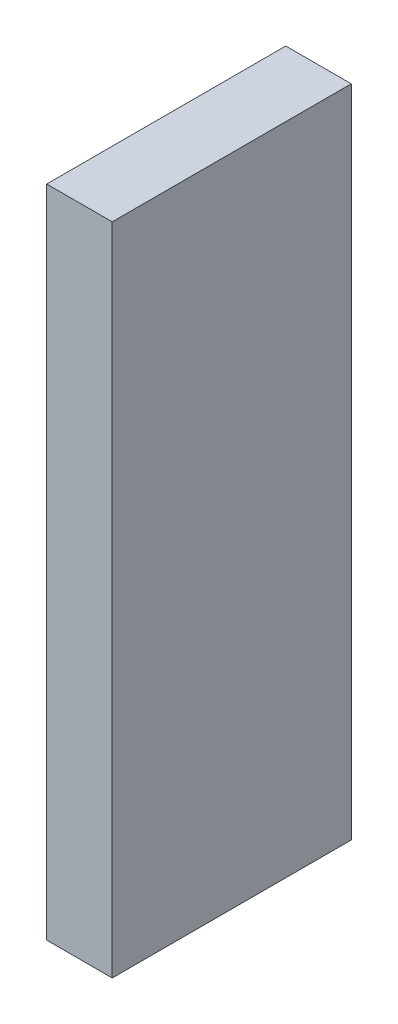
ISO-10303-21;
HEADER;
FILE_DESCRIPTION(('STEP AP214'),'2;1');
FILE_NAME('part.step','',(''),(''),'','','');
FILE_SCHEMA(('AUTOMOTIVE_DESIGN { 1 0 10303 214 1 1 1 1 }'));
ENDSEC;
DATA;
#1=APPLICATION_CONTEXT('core data for automotive mechanical design processes');
#2=APPLICATION_PROTOCOL_DEFINITION('international standard','automotive_design',2000,#1);
#3=PRODUCT_CONTEXT('',#1,'mechanical');
#4=PRODUCT('Part','Part','',(#3));
#5=PRODUCT_RELATED_PRODUCT_CATEGORY('part','',(#4));
#6=PRODUCT_DEFINITION_FORMATION('','',#4);
#7=PRODUCT_DEFINITION_CONTEXT('part definition',#1,'design');
#8=PRODUCT_DEFINITION('design','',#6,#7);
#9=PRODUCT_DEFINITION_SHAPE('','',#8);
#10=(LENGTH_UNIT() NAMED_UNIT(*) SI_UNIT(.MILLI.,.METRE.));
#11=(NAMED_UNIT(*) PLANE_ANGLE_UNIT() SI_UNIT($,.RADIAN.));
#12=(NAMED_UNIT(*) SI_UNIT($,.STERADIAN.) SOLID_ANGLE_UNIT());
#13=UNCERTAINTY_MEASURE_WITH_UNIT(LENGTH_MEASURE(1.E-05),#10,'distance_accuracy_value','');
#14=(GEOMETRIC_REPRESENTATION_CONTEXT(3) GLOBAL_UNCERTAINTY_ASSIGNED_CONTEXT((#13)) GLOBAL_UNIT_ASSIGNED_CONTEXT((#10,
#11,#12)) REPRESENTATION_CONTEXT('',''));
#15=CARTESIAN_POINT('',(0.,0.,0.));
#16=DIRECTION('',(0.,0.,1.));
#17=DIRECTION('',(1.,0.,0.));
#18=AXIS2_PLACEMENT_3D('',#15,#16,#17);
#19=CARTESIAN_POINT('',(1.27,12.7,4.6355));
#20=DIRECTION('',(-1.,0.,0.));
#21=DIRECTION('',(0.,-1.,0.));
#22=AXIS2_PLACEMENT_3D('',#19,#20,#21);
#23=PLANE('',#22);
#24=DIRECTION('',(0.,1.,0.));
#25=VECTOR('',#24,1.);
#26=CARTESIAN_POINT('',(1.27,12.7,-4.6355));
#27=LINE('',#26,#25);
#28=CARTESIAN_POINT('',(1.27,-12.7,-4.6355));
#29=VERTEX_POINT('',#28);
#30=CARTESIAN_POINT('',(1.27,12.7,-4.6355));
#31=VERTEX_POINT('',#30);
#32=EDGE_CURVE('E111',#29,#31,#27,.T.);
#33=ORIENTED_EDGE('',*,*,#32,.T.);
#34=DIRECTION('',(0.,0.,-1.));
#35=VECTOR('',#34,1.);
#36=CARTESIAN_POINT('',(1.27,12.7,4.6355));
#37=LINE('',#36,#35);
#38=CARTESIAN_POINT('',(1.27,12.7,4.6355));
#39=VERTEX_POINT('',#38);
#40=EDGE_CURVE('E11',#39,#31,#37,.T.);
#41=ORIENTED_EDGE('',*,*,#40,.F.);
#42=DIRECTION('',(0.,1.,0.));
#43=VECTOR('',#42,1.);
#44=CARTESIAN_POINT('',(1.27,12.7,4.6355));
#45=LINE('',#44,#43);
#46=CARTESIAN_POINT('',(1.27,-12.7,4.6355));
#47=VERTEX_POINT('',#46);
#48=EDGE_CURVE('E95',#47,#39,#45,.T.);
#49=ORIENTED_EDGE('',*,*,#48,.F.);
#50=DIRECTION('',(0.,0.,-1.));
#51=VECTOR('',#50,1.);
#52=CARTESIAN_POINT('',(1.27,-12.7,4.6355));
#53=LINE('',#52,#51);
#54=EDGE_CURVE('E107',#47,#29,#53,.T.);
#55=ORIENTED_EDGE('',*,*,#54,.T.);
#56=EDGE_LOOP('',(#33,#41,#49,#55));
#57=FACE_BOUND('',#56,.T.);
#58=ADVANCED_FACE('F43',(#57),#23,.F.);
#59=CARTESIAN_POINT('',(-1.27,12.7,4.6355));
#60=DIRECTION('',(0.,-1.,0.));
#61=DIRECTION('',(0.,0.,-1.));
#62=AXIS2_PLACEMENT_3D('',#59,#60,#61);
#63=PLANE('',#62);
#64=DIRECTION('',(-1.,0.,0.));
#65=VECTOR('',#64,1.);
#66=CARTESIAN_POINT('',(-1.27,12.7,-4.6355));
#67=LINE('',#66,#65);
#68=CARTESIAN_POINT('',(-1.27,12.7,-4.6355));
#69=VERTEX_POINT('',#68);
#70=EDGE_CURVE('E100',#31,#69,#67,.T.);
#71=ORIENTED_EDGE('',*,*,#70,.T.);
#72=DIRECTION('',(0.,0.,-1.));
#73=VECTOR('',#72,1.);
#74=CARTESIAN_POINT('',(-1.27,12.7,4.6355));
#75=LINE('',#74,#73);
#76=CARTESIAN_POINT('',(-1.27,12.7,4.6355));
#77=VERTEX_POINT('',#76);
#78=EDGE_CURVE('E52',#77,#69,#75,.T.);
#79=ORIENTED_EDGE('',*,*,#78,.F.);
#80=DIRECTION('',(-1.,0.,0.));
#81=VECTOR('',#80,1.);
#82=CARTESIAN_POINT('',(-1.27,12.7,4.6355));
#83=LINE('',#82,#81);
#84=EDGE_CURVE('E90',#39,#77,#83,.T.);
#85=ORIENTED_EDGE('',*,*,#84,.F.);
#86=ORIENTED_EDGE('',*,*,#40,.T.);
#87=EDGE_LOOP('',(#71,#79,#85,#86));
#88=FACE_BOUND('',#87,.T.);
#89=ADVANCED_FACE('F99',(#88),#63,.F.);
#90=CARTESIAN_POINT('',(-1.27,12.7,4.6355));
#91=DIRECTION('',(1.,0.,0.));
#92=DIRECTION('',(0.,1.,0.));
#93=AXIS2_PLACEMENT_3D('',#90,#91,#92);
#94=PLANE('',#93);
#95=DIRECTION('',(0.,-1.,0.));
#96=VECTOR('',#95,1.);
#97=CARTESIAN_POINT('',(-1.27,12.7,-4.6355));
#98=LINE('',#97,#96);
#99=CARTESIAN_POINT('',(-1.27,-12.7,-4.6355));
#100=VERTEX_POINT('',#99);
#101=EDGE_CURVE('E77',#69,#100,#98,.T.);
#102=ORIENTED_EDGE('',*,*,#101,.T.);
#103=DIRECTION('',(0.,0.,-1.));
#104=VECTOR('',#103,1.);
#105=CARTESIAN_POINT('',(-1.27,-12.7,4.6355));
#106=LINE('',#105,#104);
#107=CARTESIAN_POINT('',(-1.27,-12.7,4.6355));
#108=VERTEX_POINT('',#107);
#109=EDGE_CURVE('E102',#108,#100,#106,.T.);
#110=ORIENTED_EDGE('',*,*,#109,.F.);
#111=DIRECTION('',(0.,-1.,0.));
#112=VECTOR('',#111,1.);
#113=CARTESIAN_POINT('',(-1.27,12.7,4.6355));
#114=LINE('',#113,#112);
#115=EDGE_CURVE('E93',#77,#108,#114,.T.);
#116=ORIENTED_EDGE('',*,*,#115,.F.);
#117=ORIENTED_EDGE('',*,*,#78,.T.);
#118=EDGE_LOOP('',(#102,#110,#116,#117));
#119=FACE_BOUND('',#118,.T.);
#120=ADVANCED_FACE('F103',(#119),#94,.F.);
#121=CARTESIAN_POINT('',(-1.27,-12.7,4.6355));
#122=DIRECTION('',(0.,1.,0.));
#123=DIRECTION('',(0.,0.,1.));
#124=AXIS2_PLACEMENT_3D('',#121,#122,#123);
#125=PLANE('',#124);
#126=DIRECTION('',(1.,0.,0.));
#127=VECTOR('',#126,1.);
#128=CARTESIAN_POINT('',(-1.27,-12.7,-4.6355));
#129=LINE('',#128,#127);
#130=EDGE_CURVE('E83',#100,#29,#129,.T.);
#131=ORIENTED_EDGE('',*,*,#130,.T.);
#132=ORIENTED_EDGE('',*,*,#54,.F.);
#133=DIRECTION('',(1.,0.,0.));
#134=VECTOR('',#133,1.);
#135=CARTESIAN_POINT('',(-1.27,-12.7,4.6355));
#136=LINE('',#135,#134);
#137=EDGE_CURVE('E60',#108,#47,#136,.T.);
#138=ORIENTED_EDGE('',*,*,#137,.F.);
#139=ORIENTED_EDGE('',*,*,#109,.T.);
#140=EDGE_LOOP('',(#131,#132,#138,#139));
#141=FACE_BOUND('',#140,.T.);
#142=ADVANCED_FACE('F124',(#141),#125,.F.);
#143=CARTESIAN_POINT('',(0.,0.,4.6355));
#144=DIRECTION('',(0.,0.,1.));
#145=DIRECTION('',(1.,0.,0.));
#146=AXIS2_PLACEMENT_3D('',#143,#144,#145);
#147=PLANE('',#146);
#148=ORIENTED_EDGE('',*,*,#48,.T.);
#149=ORIENTED_EDGE('',*,*,#84,.T.);
#150=ORIENTED_EDGE('',*,*,#115,.T.);
#151=ORIENTED_EDGE('',*,*,#137,.T.);
#152=EDGE_LOOP('',(#148,#149,#150,#151));
#153=FACE_BOUND('',#152,.T.);
#154=ADVANCED_FACE('F91',(#153),#147,.T.);
#155=CARTESIAN_POINT('',(0.,0.,-4.6355));
#156=DIRECTION('',(0.,0.,1.));
#157=DIRECTION('',(1.,0.,0.));
#158=AXIS2_PLACEMENT_3D('',#155,#156,#157);
#159=PLANE('',#158);
#160=ORIENTED_EDGE('',*,*,#32,.F.);
#161=ORIENTED_EDGE('',*,*,#130,.F.);
#162=ORIENTED_EDGE('',*,*,#101,.F.);
#163=ORIENTED_EDGE('',*,*,#70,.F.);
#164=EDGE_LOOP('',(#160,#161,#162,#163));
#165=FACE_BOUND('',#164,.T.);
#166=ADVANCED_FACE('F127',(#165),#159,.F.);
#167=CLOSED_SHELL('',(#58,#89,#120,#142,#154,#166));
#168=MANIFOLD_SOLID_BREP('B2',#167);
#169=ADVANCED_BREP_SHAPE_REPRESENTATION('',(#18,#168),#14);
#170=SHAPE_DEFINITION_REPRESENTATION(#9,#169);
ENDSEC;
END-ISO-10303-21;
